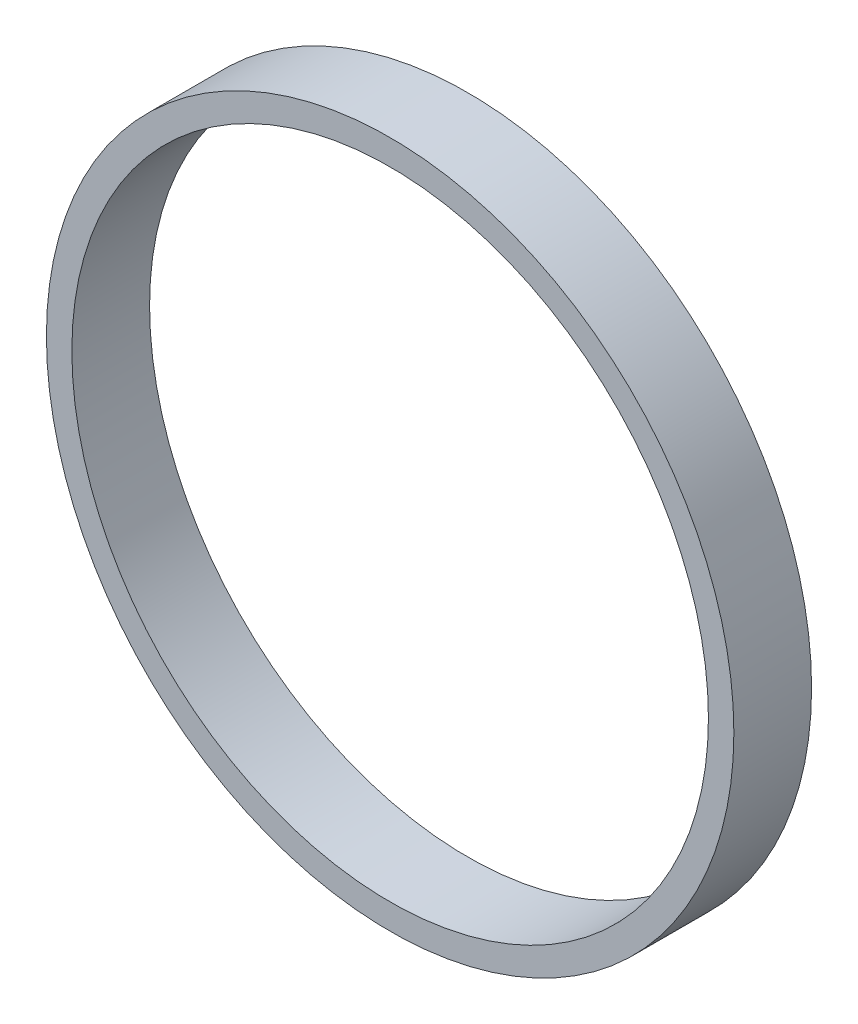
ISO-10303-21;
HEADER;
FILE_DESCRIPTION(('STEP AP214'),'2;1');
FILE_NAME('part.step','',(''),(''),'','','');
FILE_SCHEMA(('AUTOMOTIVE_DESIGN { 1 0 10303 214 1 1 1 1 }'));
ENDSEC;
DATA;
#1=APPLICATION_CONTEXT('core data for automotive mechanical design processes');
#2=APPLICATION_PROTOCOL_DEFINITION('international standard','automotive_design',2000,#1);
#3=PRODUCT_CONTEXT('',#1,'mechanical');
#4=PRODUCT('Part','Part','',(#3));
#5=PRODUCT_RELATED_PRODUCT_CATEGORY('part','',(#4));
#6=PRODUCT_DEFINITION_FORMATION('','',#4);
#7=PRODUCT_DEFINITION_CONTEXT('part definition',#1,'design');
#8=PRODUCT_DEFINITION('design','',#6,#7);
#9=PRODUCT_DEFINITION_SHAPE('','',#8);
#10=(LENGTH_UNIT() NAMED_UNIT(*) SI_UNIT(.MILLI.,.METRE.));
#11=(NAMED_UNIT(*) PLANE_ANGLE_UNIT() SI_UNIT($,.RADIAN.));
#12=(NAMED_UNIT(*) SI_UNIT($,.STERADIAN.) SOLID_ANGLE_UNIT());
#13=UNCERTAINTY_MEASURE_WITH_UNIT(LENGTH_MEASURE(1.E-05),#10,'distance_accuracy_value','');
#14=(GEOMETRIC_REPRESENTATION_CONTEXT(3) GLOBAL_UNCERTAINTY_ASSIGNED_CONTEXT((#13)) GLOBAL_UNIT_ASSIGNED_CONTEXT((#10,
#11,#12)) REPRESENTATION_CONTEXT('',''));
#15=CARTESIAN_POINT('',(0.,0.,0.));
#16=DIRECTION('',(0.,0.,1.));
#17=DIRECTION('',(1.,0.,0.));
#18=AXIS2_PLACEMENT_3D('',#15,#16,#17);
#19=CARTESIAN_POINT('',(0.,0.,5.5));
#20=DIRECTION('',(0.,0.,1.));
#21=DIRECTION('',(1.,0.,0.));
#22=AXIS2_PLACEMENT_3D('',#19,#20,#21);
#23=PLANE('',#22);
#24=CARTESIAN_POINT('',(0.,0.,5.5));
#25=DIRECTION('',(0.,0.,1.));
#26=DIRECTION('',(1.,0.,0.));
#27=AXIS2_PLACEMENT_3D('',#24,#25,#26);
#28=CIRCLE('',#27,24.325);
#29=CARTESIAN_POINT('',(24.325,0.,5.5));
#30=VERTEX_POINT('',#29);
#31=EDGE_CURVE('E10',#30,#30,#28,.T.);
#32=ORIENTED_EDGE('',*,*,#31,.T.);
#33=EDGE_LOOP('',(#32));
#34=FACE_BOUND('',#33,.T.);
#35=CARTESIAN_POINT('',(0.,0.,5.5));
#36=DIRECTION('',(0.,0.,1.));
#37=DIRECTION('',(1.,0.,0.));
#38=AXIS2_PLACEMENT_3D('',#35,#36,#37);
#39=CIRCLE('',#38,22.525);
#40=CARTESIAN_POINT('',(22.525,0.,5.5));
#41=VERTEX_POINT('',#40);
#42=EDGE_CURVE('E46',#41,#41,#39,.T.);
#43=ORIENTED_EDGE('',*,*,#42,.F.);
#44=EDGE_LOOP('',(#43));
#45=FACE_BOUND('',#44,.T.);
#46=ADVANCED_FACE('F35',(#34,#45),#23,.T.);
#47=CARTESIAN_POINT('',(0.,0.,0.));
#48=DIRECTION('',(0.,0.,1.));
#49=DIRECTION('',(1.,0.,0.));
#50=AXIS2_PLACEMENT_3D('',#47,#48,#49);
#51=PLANE('',#50);
#52=CARTESIAN_POINT('',(0.,0.,0.));
#53=DIRECTION('',(0.,0.,1.));
#54=DIRECTION('',(1.,0.,0.));
#55=AXIS2_PLACEMENT_3D('',#52,#53,#54);
#56=CIRCLE('',#55,24.325);
#57=CARTESIAN_POINT('',(24.325,0.,0.));
#58=VERTEX_POINT('',#57);
#59=EDGE_CURVE('E39',#58,#58,#56,.T.);
#60=ORIENTED_EDGE('',*,*,#59,.F.);
#61=EDGE_LOOP('',(#60));
#62=FACE_BOUND('',#61,.T.);
#63=CARTESIAN_POINT('',(0.,0.,0.));
#64=DIRECTION('',(0.,0.,1.));
#65=DIRECTION('',(1.,0.,0.));
#66=AXIS2_PLACEMENT_3D('',#63,#64,#65);
#67=CIRCLE('',#66,22.525);
#68=CARTESIAN_POINT('',(22.525,0.,0.));
#69=VERTEX_POINT('',#68);
#70=EDGE_CURVE('E48',#69,#69,#67,.T.);
#71=ORIENTED_EDGE('',*,*,#70,.T.);
#72=EDGE_LOOP('',(#71));
#73=FACE_BOUND('',#72,.T.);
#74=ADVANCED_FACE('F58',(#62,#73),#51,.F.);
#75=CARTESIAN_POINT('',(0.,0.,5.5));
#76=DIRECTION('',(0.,0.,-1.));
#77=DIRECTION('',(-1.,0.,0.));
#78=AXIS2_PLACEMENT_3D('',#75,#76,#77);
#79=CYLINDRICAL_SURFACE('',#78,24.325);
#80=ORIENTED_EDGE('',*,*,#31,.F.);
#81=EDGE_LOOP('',(#80));
#82=FACE_BOUND('',#81,.T.);
#83=ORIENTED_EDGE('',*,*,#59,.T.);
#84=EDGE_LOOP('',(#83));
#85=FACE_BOUND('',#84,.T.);
#86=ADVANCED_FACE('F37',(#82,#85),#79,.T.);
#87=CARTESIAN_POINT('',(0.,0.,5.5));
#88=DIRECTION('',(0.,0.,-1.));
#89=DIRECTION('',(-1.,0.,0.));
#90=AXIS2_PLACEMENT_3D('',#87,#88,#89);
#91=CYLINDRICAL_SURFACE('',#90,22.525);
#92=ORIENTED_EDGE('',*,*,#42,.T.);
#93=EDGE_LOOP('',(#92));
#94=FACE_BOUND('',#93,.T.);
#95=ORIENTED_EDGE('',*,*,#70,.F.);
#96=EDGE_LOOP('',(#95));
#97=FACE_BOUND('',#96,.T.);
#98=ADVANCED_FACE('F54',(#94,#97),#91,.F.);
#99=CLOSED_SHELL('',(#46,#74,#86,#98));
#100=MANIFOLD_SOLID_BREP('B2',#99);
#101=ADVANCED_BREP_SHAPE_REPRESENTATION('',(#18,#100),#14);
#102=SHAPE_DEFINITION_REPRESENTATION(#9,#101);
ENDSEC;
END-ISO-10303-21;
